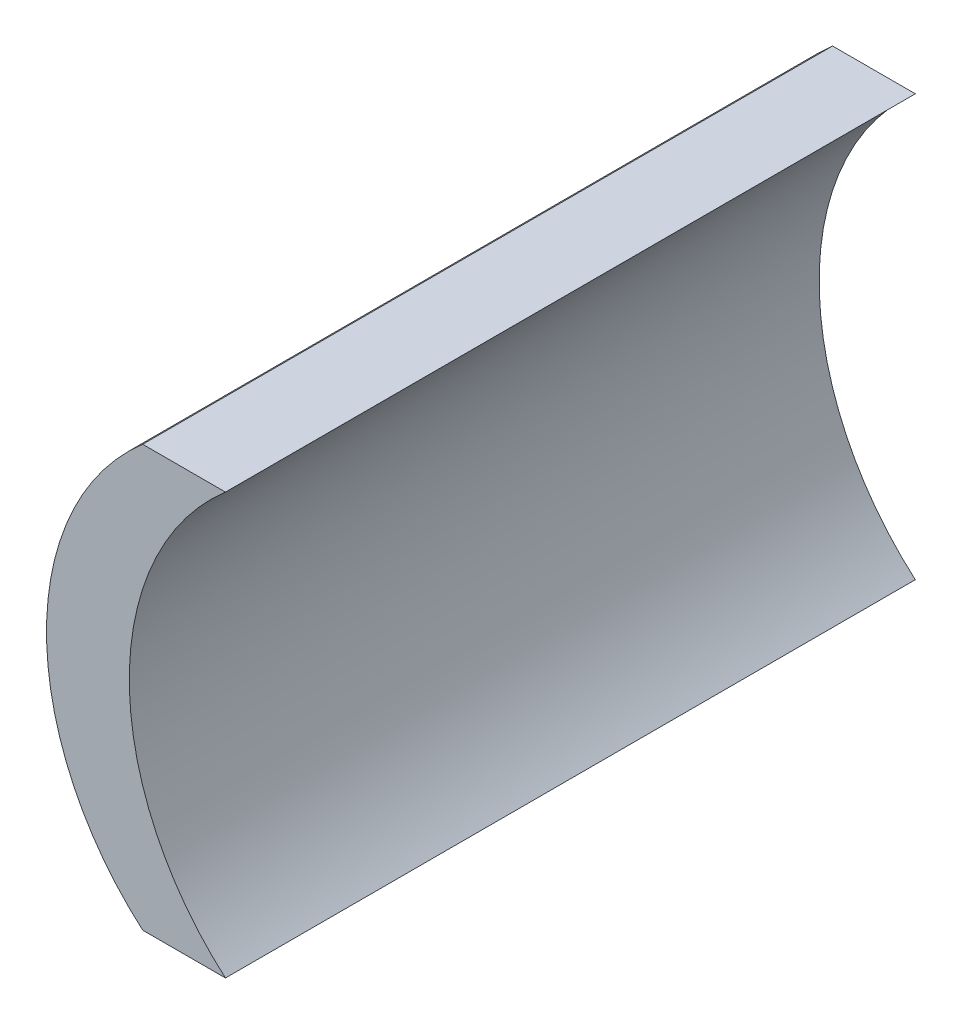
ISO-10303-21;
HEADER;
FILE_DESCRIPTION(('STEP AP214'),'2;1');
FILE_NAME('part.step','',(''),(''),'','','');
FILE_SCHEMA(('AUTOMOTIVE_DESIGN { 1 0 10303 214 1 1 1 1 }'));
ENDSEC;
DATA;
#1=APPLICATION_CONTEXT('core data for automotive mechanical design processes');
#2=APPLICATION_PROTOCOL_DEFINITION('international standard','automotive_design',2000,#1);
#3=PRODUCT_CONTEXT('',#1,'mechanical');
#4=PRODUCT('Part','Part','',(#3));
#5=PRODUCT_RELATED_PRODUCT_CATEGORY('part','',(#4));
#6=PRODUCT_DEFINITION_FORMATION('','',#4);
#7=PRODUCT_DEFINITION_CONTEXT('part definition',#1,'design');
#8=PRODUCT_DEFINITION('design','',#6,#7);
#9=PRODUCT_DEFINITION_SHAPE('','',#8);
#10=(LENGTH_UNIT() NAMED_UNIT(*) SI_UNIT(.MILLI.,.METRE.));
#11=(NAMED_UNIT(*) PLANE_ANGLE_UNIT() SI_UNIT($,.RADIAN.));
#12=(NAMED_UNIT(*) SI_UNIT($,.STERADIAN.) SOLID_ANGLE_UNIT());
#13=UNCERTAINTY_MEASURE_WITH_UNIT(LENGTH_MEASURE(1.E-05),#10,'distance_accuracy_value','');
#14=(GEOMETRIC_REPRESENTATION_CONTEXT(3) GLOBAL_UNCERTAINTY_ASSIGNED_CONTEXT((#13)) GLOBAL_UNIT_ASSIGNED_CONTEXT((#10,
#11,#12)) REPRESENTATION_CONTEXT('',''));
#15=CARTESIAN_POINT('',(0.,0.,0.));
#16=DIRECTION('',(0.,0.,1.));
#17=DIRECTION('',(1.,0.,0.));
#18=AXIS2_PLACEMENT_3D('',#15,#16,#17);
#19=CARTESIAN_POINT('',(0.,9.15,30.));
#20=DIRECTION('',(0.,1.,0.));
#21=DIRECTION('',(0.,0.,1.));
#22=AXIS2_PLACEMENT_3D('',#19,#20,#21);
#23=PLANE('',#22);
#24=DIRECTION('',(1.,0.,0.));
#25=VECTOR('',#24,1.);
#26=CARTESIAN_POINT('',(0.,9.15,0.));
#27=LINE('',#26,#25);
#28=CARTESIAN_POINT('',(-11.5175438110566,9.15,0.));
#29=VERTEX_POINT('',#28);
#30=CARTESIAN_POINT('',(-7.91754381105656,9.15,0.));
#31=VERTEX_POINT('',#30);
#32=EDGE_CURVE('E100',#29,#31,#27,.T.);
#33=ORIENTED_EDGE('',*,*,#32,.F.);
#34=DIRECTION('',(0.,0.,-1.));
#35=VECTOR('',#34,1.);
#36=CARTESIAN_POINT('',(-11.5175438110566,9.15,30.));
#37=LINE('',#36,#35);
#38=CARTESIAN_POINT('',(-11.5175438110566,9.15,30.));
#39=VERTEX_POINT('',#38);
#40=EDGE_CURVE('E11',#39,#29,#37,.T.);
#41=ORIENTED_EDGE('',*,*,#40,.F.);
#42=DIRECTION('',(1.,0.,0.));
#43=VECTOR('',#42,1.);
#44=CARTESIAN_POINT('',(0.,9.15,30.));
#45=LINE('',#44,#43);
#46=CARTESIAN_POINT('',(-7.91754381105656,9.15,30.));
#47=VERTEX_POINT('',#46);
#48=EDGE_CURVE('E85',#39,#47,#45,.T.);
#49=ORIENTED_EDGE('',*,*,#48,.T.);
#50=DIRECTION('',(0.,0.,-1.));
#51=VECTOR('',#50,1.);
#52=CARTESIAN_POINT('',(-7.91754381105656,9.15,30.));
#53=LINE('',#52,#51);
#54=EDGE_CURVE('E53',#47,#31,#53,.T.);
#55=ORIENTED_EDGE('',*,*,#54,.T.);
#56=EDGE_LOOP('',(#33,#41,#49,#55));
#57=FACE_BOUND('',#56,.T.);
#58=ADVANCED_FACE('F37',(#57),#23,.T.);
#59=CARTESIAN_POINT('',(-3.6,0.,30.));
#60=DIRECTION('',(0.,0.,-1.));
#61=DIRECTION('',(-1.,0.,0.));
#62=AXIS2_PLACEMENT_3D('',#59,#60,#61);
#63=CYLINDRICAL_SURFACE('',#62,12.1);
#64=CARTESIAN_POINT('',(-3.6,0.,0.));
#65=DIRECTION('',(0.,0.,1.));
#66=DIRECTION('',(1.,0.,0.));
#67=AXIS2_PLACEMENT_3D('',#64,#65,#66);
#68=CIRCLE('',#67,12.1);
#69=CARTESIAN_POINT('',(-11.5175438110566,-9.15,0.));
#70=VERTEX_POINT('',#69);
#71=EDGE_CURVE('E91',#29,#70,#68,.T.);
#72=ORIENTED_EDGE('',*,*,#71,.T.);
#73=DIRECTION('',(0.,0.,-1.));
#74=VECTOR('',#73,1.);
#75=CARTESIAN_POINT('',(-11.5175438110566,-9.15,30.));
#76=LINE('',#75,#74);
#77=CARTESIAN_POINT('',(-11.5175438110566,-9.15,30.));
#78=VERTEX_POINT('',#77);
#79=EDGE_CURVE('E45',#78,#70,#76,.T.);
#80=ORIENTED_EDGE('',*,*,#79,.F.);
#81=CARTESIAN_POINT('',(-3.6,0.,30.));
#82=DIRECTION('',(0.,0.,1.));
#83=DIRECTION('',(1.,0.,0.));
#84=AXIS2_PLACEMENT_3D('',#81,#82,#83);
#85=CIRCLE('',#84,12.1);
#86=EDGE_CURVE('E79',#39,#78,#85,.T.);
#87=ORIENTED_EDGE('',*,*,#86,.F.);
#88=ORIENTED_EDGE('',*,*,#40,.T.);
#89=EDGE_LOOP('',(#72,#80,#87,#88));
#90=FACE_BOUND('',#89,.T.);
#91=ADVANCED_FACE('F89',(#90),#63,.T.);
#92=CARTESIAN_POINT('',(0.,-9.15,30.));
#93=DIRECTION('',(0.,1.,0.));
#94=DIRECTION('',(0.,0.,1.));
#95=AXIS2_PLACEMENT_3D('',#92,#93,#94);
#96=PLANE('',#95);
#97=DIRECTION('',(1.,0.,0.));
#98=VECTOR('',#97,1.);
#99=CARTESIAN_POINT('',(0.,-9.15,0.));
#100=LINE('',#99,#98);
#101=CARTESIAN_POINT('',(-7.91754381105656,-9.15,0.));
#102=VERTEX_POINT('',#101);
#103=EDGE_CURVE('E103',#70,#102,#100,.T.);
#104=ORIENTED_EDGE('',*,*,#103,.T.);
#105=DIRECTION('',(0.,0.,-1.));
#106=VECTOR('',#105,1.);
#107=CARTESIAN_POINT('',(-7.91754381105656,-9.15,30.));
#108=LINE('',#107,#106);
#109=CARTESIAN_POINT('',(-7.91754381105656,-9.15,30.));
#110=VERTEX_POINT('',#109);
#111=EDGE_CURVE('E67',#110,#102,#108,.T.);
#112=ORIENTED_EDGE('',*,*,#111,.F.);
#113=DIRECTION('',(1.,0.,0.));
#114=VECTOR('',#113,1.);
#115=CARTESIAN_POINT('',(0.,-9.15,30.));
#116=LINE('',#115,#114);
#117=EDGE_CURVE('E84',#78,#110,#116,.T.);
#118=ORIENTED_EDGE('',*,*,#117,.F.);
#119=ORIENTED_EDGE('',*,*,#79,.T.);
#120=EDGE_LOOP('',(#104,#112,#118,#119));
#121=FACE_BOUND('',#120,.T.);
#122=ADVANCED_FACE('F94',(#121),#96,.F.);
#123=CARTESIAN_POINT('',(0.,0.,30.));
#124=DIRECTION('',(0.,0.,-1.));
#125=DIRECTION('',(-1.,0.,0.));
#126=AXIS2_PLACEMENT_3D('',#123,#124,#125);
#127=CYLINDRICAL_SURFACE('',#126,12.1);
#128=CARTESIAN_POINT('',(0.,0.,0.));
#129=DIRECTION('',(0.,0.,1.));
#130=DIRECTION('',(1.,0.,0.));
#131=AXIS2_PLACEMENT_3D('',#128,#129,#130);
#132=CIRCLE('',#131,12.1);
#133=EDGE_CURVE('E105',#31,#102,#132,.T.);
#134=ORIENTED_EDGE('',*,*,#133,.F.);
#135=ORIENTED_EDGE('',*,*,#54,.F.);
#136=CARTESIAN_POINT('',(0.,0.,30.));
#137=DIRECTION('',(0.,0.,1.));
#138=DIRECTION('',(1.,0.,0.));
#139=AXIS2_PLACEMENT_3D('',#136,#137,#138);
#140=CIRCLE('',#139,12.1);
#141=EDGE_CURVE('E95',#47,#110,#140,.T.);
#142=ORIENTED_EDGE('',*,*,#141,.T.);
#143=ORIENTED_EDGE('',*,*,#111,.T.);
#144=EDGE_LOOP('',(#134,#135,#142,#143));
#145=FACE_BOUND('',#144,.T.);
#146=ADVANCED_FACE('F110',(#145),#127,.F.);
#147=CARTESIAN_POINT('',(0.,0.,30.));
#148=DIRECTION('',(0.,0.,1.));
#149=DIRECTION('',(1.,0.,0.));
#150=AXIS2_PLACEMENT_3D('',#147,#148,#149);
#151=PLANE('',#150);
#152=ORIENTED_EDGE('',*,*,#48,.F.);
#153=ORIENTED_EDGE('',*,*,#86,.T.);
#154=ORIENTED_EDGE('',*,*,#117,.T.);
#155=ORIENTED_EDGE('',*,*,#141,.F.);
#156=EDGE_LOOP('',(#152,#153,#154,#155));
#157=FACE_BOUND('',#156,.T.);
#158=ADVANCED_FACE('F81',(#157),#151,.T.);
#159=CARTESIAN_POINT('',(0.,0.,0.));
#160=DIRECTION('',(0.,0.,1.));
#161=DIRECTION('',(1.,0.,0.));
#162=AXIS2_PLACEMENT_3D('',#159,#160,#161);
#163=PLANE('',#162);
#164=ORIENTED_EDGE('',*,*,#32,.T.);
#165=ORIENTED_EDGE('',*,*,#133,.T.);
#166=ORIENTED_EDGE('',*,*,#103,.F.);
#167=ORIENTED_EDGE('',*,*,#71,.F.);
#168=EDGE_LOOP('',(#164,#165,#166,#167));
#169=FACE_BOUND('',#168,.T.);
#170=ADVANCED_FACE('F117',(#169),#163,.F.);
#171=CLOSED_SHELL('',(#58,#91,#122,#146,#158,#170));
#172=MANIFOLD_SOLID_BREP('B2',#171);
#173=ADVANCED_BREP_SHAPE_REPRESENTATION('',(#18,#172),#14);
#174=SHAPE_DEFINITION_REPRESENTATION(#9,#173);
ENDSEC;
END-ISO-10303-21;
